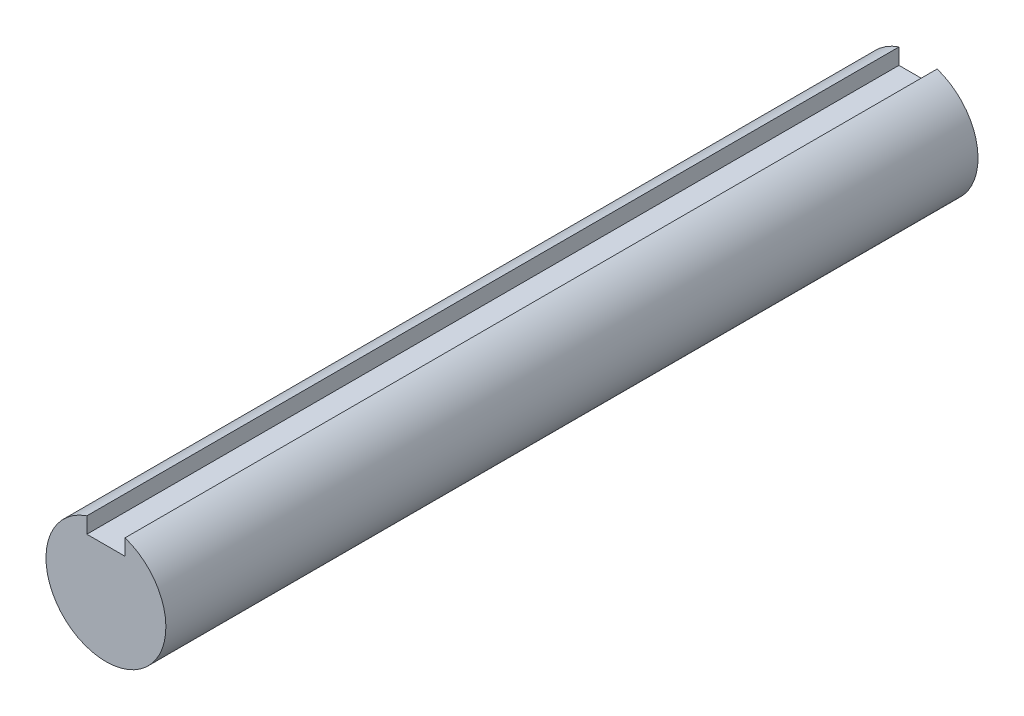
ISO-10303-21;
HEADER;
FILE_DESCRIPTION(('STEP AP214'),'2;1');
FILE_NAME('part.step','',(''),(''),'','','');
FILE_SCHEMA(('AUTOMOTIVE_DESIGN { 1 0 10303 214 1 1 1 1 }'));
ENDSEC;
DATA;
#1=APPLICATION_CONTEXT('core data for automotive mechanical design processes');
#2=APPLICATION_PROTOCOL_DEFINITION('international standard','automotive_design',2000,#1);
#3=PRODUCT_CONTEXT('',#1,'mechanical');
#4=PRODUCT('Part','Part','',(#3));
#5=PRODUCT_RELATED_PRODUCT_CATEGORY('part','',(#4));
#6=PRODUCT_DEFINITION_FORMATION('','',#4);
#7=PRODUCT_DEFINITION_CONTEXT('part definition',#1,'design');
#8=PRODUCT_DEFINITION('design','',#6,#7);
#9=PRODUCT_DEFINITION_SHAPE('','',#8);
#10=(LENGTH_UNIT() NAMED_UNIT(*) SI_UNIT(.MILLI.,.METRE.));
#11=(NAMED_UNIT(*) PLANE_ANGLE_UNIT() SI_UNIT($,.RADIAN.));
#12=(NAMED_UNIT(*) SI_UNIT($,.STERADIAN.) SOLID_ANGLE_UNIT());
#13=UNCERTAINTY_MEASURE_WITH_UNIT(LENGTH_MEASURE(1.E-05),#10,'distance_accuracy_value','');
#14=(GEOMETRIC_REPRESENTATION_CONTEXT(3) GLOBAL_UNCERTAINTY_ASSIGNED_CONTEXT((#13)) GLOBAL_UNIT_ASSIGNED_CONTEXT((#10,
#11,#12)) REPRESENTATION_CONTEXT('',''));
#15=CARTESIAN_POINT('',(0.,0.,0.));
#16=DIRECTION('',(0.,0.,1.));
#17=DIRECTION('',(1.,0.,0.));
#18=AXIS2_PLACEMENT_3D('',#15,#16,#17);
#19=CARTESIAN_POINT('',(0.,0.,50.8));
#20=DIRECTION('',(0.,0.,-1.));
#21=DIRECTION('',(-1.,0.,0.));
#22=AXIS2_PLACEMENT_3D('',#19,#20,#21);
#23=CYLINDRICAL_SURFACE('',#22,7.499985);
#24=CARTESIAN_POINT('',(0.,0.,50.8));
#25=DIRECTION('',(0.,0.,1.));
#26=DIRECTION('',(1.,0.,0.));
#27=AXIS2_PLACEMENT_3D('',#24,#25,#26);
#28=CIRCLE('',#27,7.499985);
#29=CARTESIAN_POINT('',(-2.3876,7.10979192664771,50.8));
#30=VERTEX_POINT('',#29);
#31=CARTESIAN_POINT('',(2.3876,7.10979192664771,50.8));
#32=VERTEX_POINT('',#31);
#33=EDGE_CURVE('E44',#30,#32,#28,.T.);
#34=ORIENTED_EDGE('',*,*,#33,.F.);
#35=DIRECTION('',(0.,0.,-1.));
#36=VECTOR('',#35,1.);
#37=CARTESIAN_POINT('',(-2.3876,7.10979192664771,50.8));
#38=LINE('',#37,#36);
#39=CARTESIAN_POINT('',(-2.3876,7.10979192664771,-50.8));
#40=VERTEX_POINT('',#39);
#41=EDGE_CURVE('E78',#30,#40,#38,.T.);
#42=ORIENTED_EDGE('',*,*,#41,.T.);
#43=CARTESIAN_POINT('',(0.,0.,-50.8));
#44=DIRECTION('',(0.,0.,1.));
#45=DIRECTION('',(1.,0.,0.));
#46=AXIS2_PLACEMENT_3D('',#43,#44,#45);
#47=CIRCLE('',#46,7.499985);
#48=CARTESIAN_POINT('',(2.3876,7.10979192664771,-50.8));
#49=VERTEX_POINT('',#48);
#50=EDGE_CURVE('E105',#40,#49,#47,.T.);
#51=ORIENTED_EDGE('',*,*,#50,.T.);
#52=DIRECTION('',(0.,0.,-1.));
#53=VECTOR('',#52,1.);
#54=CARTESIAN_POINT('',(2.3876,7.10979192664771,50.8));
#55=LINE('',#54,#53);
#56=EDGE_CURVE('E100',#49,#32,#55,.F.);
#57=ORIENTED_EDGE('',*,*,#56,.T.);
#58=EDGE_LOOP('',(#34,#42,#51,#57));
#59=FACE_BOUND('',#58,.T.);
#60=ADVANCED_FACE('F37',(#59),#23,.T.);
#61=CARTESIAN_POINT('',(0.,0.,50.8));
#62=DIRECTION('',(0.,0.,1.));
#63=DIRECTION('',(1.,0.,0.));
#64=AXIS2_PLACEMENT_3D('',#61,#62,#63);
#65=PLANE('',#64);
#66=DIRECTION('',(0.,-1.,0.));
#67=VECTOR('',#66,1.);
#68=CARTESIAN_POINT('',(-2.3876,7.9375,50.8));
#69=LINE('',#68,#67);
#70=CARTESIAN_POINT('',(-2.3876,5.11302,50.8));
#71=VERTEX_POINT('',#70);
#72=EDGE_CURVE('E73',#30,#71,#69,.T.);
#73=ORIENTED_EDGE('',*,*,#72,.F.);
#74=ORIENTED_EDGE('',*,*,#33,.T.);
#75=DIRECTION('',(0.,1.,0.));
#76=VECTOR('',#75,1.);
#77=CARTESIAN_POINT('',(2.3876,7.9375,50.8));
#78=LINE('',#77,#76);
#79=CARTESIAN_POINT('',(2.3876,5.11302,50.8));
#80=VERTEX_POINT('',#79);
#81=EDGE_CURVE('E94',#80,#32,#78,.T.);
#82=ORIENTED_EDGE('',*,*,#81,.F.);
#83=DIRECTION('',(1.,0.,0.));
#84=VECTOR('',#83,1.);
#85=CARTESIAN_POINT('',(-2.3876,5.11302,50.8));
#86=LINE('',#85,#84);
#87=EDGE_CURVE('E83',#71,#80,#86,.T.);
#88=ORIENTED_EDGE('',*,*,#87,.F.);
#89=EDGE_LOOP('',(#73,#74,#82,#88));
#90=FACE_BOUND('',#89,.T.);
#91=ADVANCED_FACE('F93',(#90),#65,.T.);
#92=CARTESIAN_POINT('',(0.,0.,-50.8));
#93=DIRECTION('',(0.,0.,1.));
#94=DIRECTION('',(1.,0.,0.));
#95=AXIS2_PLACEMENT_3D('',#92,#93,#94);
#96=PLANE('',#95);
#97=ORIENTED_EDGE('',*,*,#50,.F.);
#98=DIRECTION('',(0.,-1.,0.));
#99=VECTOR('',#98,1.);
#100=CARTESIAN_POINT('',(-2.3876,0.,-50.8));
#101=LINE('',#100,#99);
#102=CARTESIAN_POINT('',(-2.3876,5.11302,-50.8));
#103=VERTEX_POINT('',#102);
#104=EDGE_CURVE('E11',#40,#103,#101,.T.);
#105=ORIENTED_EDGE('',*,*,#104,.T.);
#106=DIRECTION('',(1.,0.,0.));
#107=VECTOR('',#106,1.);
#108=CARTESIAN_POINT('',(-2.3876,5.11302,-50.8));
#109=LINE('',#108,#107);
#110=CARTESIAN_POINT('',(2.3876,5.11302,-50.8));
#111=VERTEX_POINT('',#110);
#112=EDGE_CURVE('E90',#103,#111,#109,.T.);
#113=ORIENTED_EDGE('',*,*,#112,.T.);
#114=DIRECTION('',(0.,1.,0.));
#115=VECTOR('',#114,1.);
#116=CARTESIAN_POINT('',(2.3876,7.9375,-50.8));
#117=LINE('',#116,#115);
#118=EDGE_CURVE('E51',#111,#49,#117,.T.);
#119=ORIENTED_EDGE('',*,*,#118,.T.);
#120=EDGE_LOOP('',(#97,#105,#113,#119));
#121=FACE_BOUND('',#120,.T.);
#122=ADVANCED_FACE('F110',(#121),#96,.F.);
#123=CARTESIAN_POINT('',(-2.3876,7.9375,-50.8));
#124=DIRECTION('',(-1.,0.,0.));
#125=DIRECTION('',(0.,-1.,0.));
#126=AXIS2_PLACEMENT_3D('',#123,#124,#125);
#127=PLANE('',#126);
#128=ORIENTED_EDGE('',*,*,#72,.T.);
#129=DIRECTION('',(0.,0.,1.));
#130=VECTOR('',#129,1.);
#131=CARTESIAN_POINT('',(-2.3876,5.11302,-50.8));
#132=LINE('',#131,#130);
#133=EDGE_CURVE('E76',#103,#71,#132,.T.);
#134=ORIENTED_EDGE('',*,*,#133,.F.);
#135=ORIENTED_EDGE('',*,*,#104,.F.);
#136=ORIENTED_EDGE('',*,*,#41,.F.);
#137=EDGE_LOOP('',(#128,#134,#135,#136));
#138=FACE_BOUND('',#137,.T.);
#139=ADVANCED_FACE('F75',(#138),#127,.F.);
#140=CARTESIAN_POINT('',(2.3876,7.9375,-50.8));
#141=DIRECTION('',(1.,0.,0.));
#142=DIRECTION('',(0.,1.,0.));
#143=AXIS2_PLACEMENT_3D('',#140,#141,#142);
#144=PLANE('',#143);
#145=ORIENTED_EDGE('',*,*,#118,.F.);
#146=DIRECTION('',(0.,0.,1.));
#147=VECTOR('',#146,1.);
#148=CARTESIAN_POINT('',(2.3876,5.11302,-50.8));
#149=LINE('',#148,#147);
#150=EDGE_CURVE('E91',#111,#80,#149,.T.);
#151=ORIENTED_EDGE('',*,*,#150,.T.);
#152=ORIENTED_EDGE('',*,*,#81,.T.);
#153=ORIENTED_EDGE('',*,*,#56,.F.);
#154=EDGE_LOOP('',(#145,#151,#152,#153));
#155=FACE_BOUND('',#154,.T.);
#156=ADVANCED_FACE('F116',(#155),#144,.F.);
#157=CARTESIAN_POINT('',(-2.3876,5.11302,-50.8));
#158=DIRECTION('',(0.,-1.,0.));
#159=DIRECTION('',(0.,0.,-1.));
#160=AXIS2_PLACEMENT_3D('',#157,#158,#159);
#161=PLANE('',#160);
#162=ORIENTED_EDGE('',*,*,#150,.F.);
#163=ORIENTED_EDGE('',*,*,#112,.F.);
#164=ORIENTED_EDGE('',*,*,#133,.T.);
#165=ORIENTED_EDGE('',*,*,#87,.T.);
#166=EDGE_LOOP('',(#162,#163,#164,#165));
#167=FACE_BOUND('',#166,.T.);
#168=ADVANCED_FACE('F87',(#167),#161,.F.);
#169=CLOSED_SHELL('',(#60,#91,#122,#139,#156,#168));
#170=MANIFOLD_SOLID_BREP('B2',#169);
#171=ADVANCED_BREP_SHAPE_REPRESENTATION('',(#18,#170),#14);
#172=SHAPE_DEFINITION_REPRESENTATION(#9,#171);
ENDSEC;
END-ISO-10303-21;
